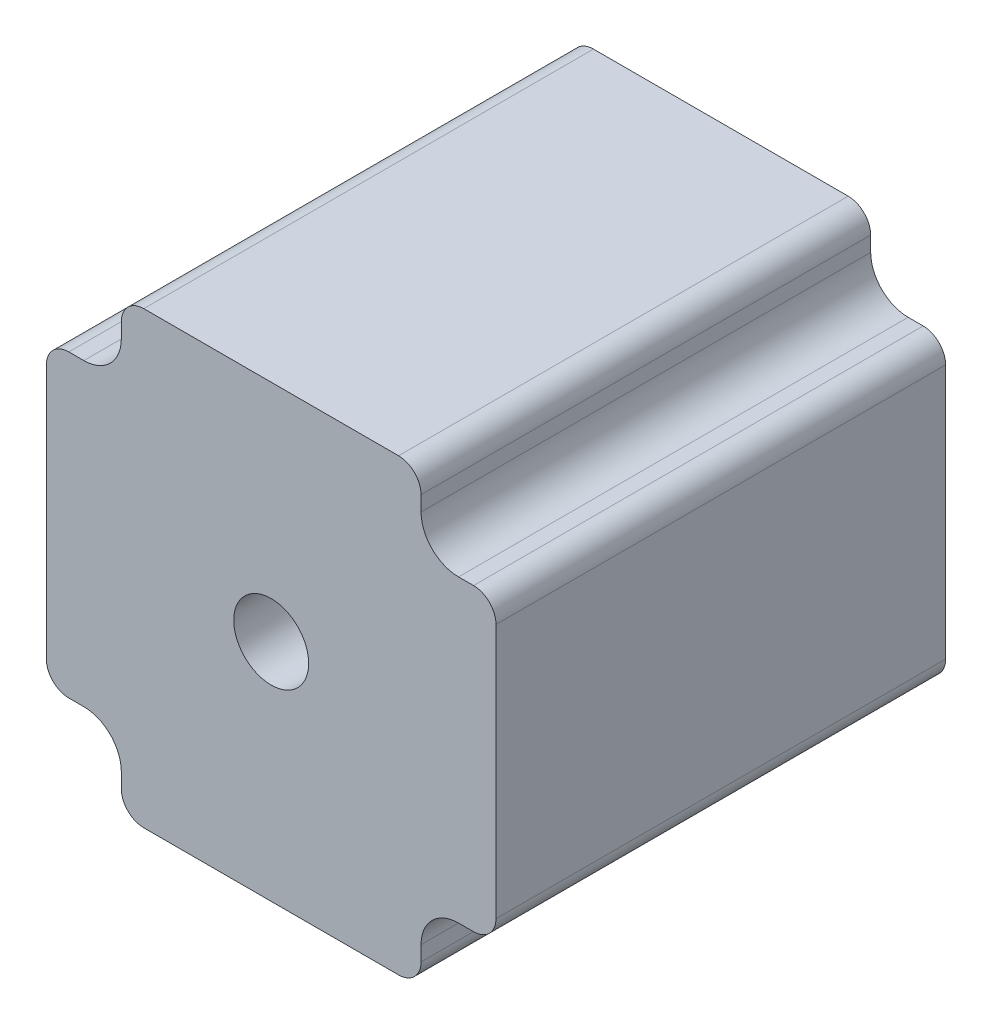
ISO-10303-21;
HEADER;
FILE_DESCRIPTION(('STEP AP214'),'2;1');
FILE_NAME('part.step','',(''),(''),'','','');
FILE_SCHEMA(('AUTOMOTIVE_DESIGN { 1 0 10303 214 1 1 1 1 }'));
ENDSEC;
DATA;
#1=APPLICATION_CONTEXT('core data for automotive mechanical design processes');
#2=APPLICATION_PROTOCOL_DEFINITION('international standard','automotive_design',2000,#1);
#3=PRODUCT_CONTEXT('',#1,'mechanical');
#4=PRODUCT('Part','Part','',(#3));
#5=PRODUCT_RELATED_PRODUCT_CATEGORY('part','',(#4));
#6=PRODUCT_DEFINITION_FORMATION('','',#4);
#7=PRODUCT_DEFINITION_CONTEXT('part definition',#1,'design');
#8=PRODUCT_DEFINITION('design','',#6,#7);
#9=PRODUCT_DEFINITION_SHAPE('','',#8);
#10=(LENGTH_UNIT() NAMED_UNIT(*) SI_UNIT(.MILLI.,.METRE.));
#11=(NAMED_UNIT(*) PLANE_ANGLE_UNIT() SI_UNIT($,.RADIAN.));
#12=(NAMED_UNIT(*) SI_UNIT($,.STERADIAN.) SOLID_ANGLE_UNIT());
#13=UNCERTAINTY_MEASURE_WITH_UNIT(LENGTH_MEASURE(1.E-05),#10,'distance_accuracy_value','');
#14=(GEOMETRIC_REPRESENTATION_CONTEXT(3) GLOBAL_UNCERTAINTY_ASSIGNED_CONTEXT((#13)) GLOBAL_UNIT_ASSIGNED_CONTEXT((#10,
#11,#12)) REPRESENTATION_CONTEXT('',''));
#15=CARTESIAN_POINT('',(0.,0.,0.));
#16=DIRECTION('',(0.,0.,1.));
#17=DIRECTION('',(1.,0.,0.));
#18=AXIS2_PLACEMENT_3D('',#15,#16,#17);
#19=CARTESIAN_POINT('',(-50.2998692886061,-21.2682776228901,60.));
#20=DIRECTION('',(0.,0.,-1.));
#21=DIRECTION('',(-1.,0.,0.));
#22=AXIS2_PLACEMENT_3D('',#19,#20,#21);
#23=CYLINDRICAL_SURFACE('',#22,5.);
#24=CARTESIAN_POINT('',(-50.2998692886061,-21.2682776228901,0.));
#25=DIRECTION('',(0.,0.,-1.));
#26=DIRECTION('',(1.,0.,0.));
#27=AXIS2_PLACEMENT_3D('',#24,#25,#26);
#28=CIRCLE('',#27,5.);
#29=CARTESIAN_POINT('',(-50.2998692886062,-16.2682776228901,0.));
#30=VERTEX_POINT('',#29);
#31=CARTESIAN_POINT('',(-45.2998692886061,-21.2682776228901,0.));
#32=VERTEX_POINT('',#31);
#33=EDGE_CURVE('E228',#30,#32,#28,.T.);
#34=ORIENTED_EDGE('',*,*,#33,.T.);
#35=DIRECTION('',(0.,0.,-1.));
#36=VECTOR('',#35,1.);
#37=CARTESIAN_POINT('',(-45.2998692886061,-21.2682776228901,60.));
#38=LINE('',#37,#36);
#39=CARTESIAN_POINT('',(-45.2998692886061,-21.2682776228901,60.));
#40=VERTEX_POINT('',#39);
#41=EDGE_CURVE('E11',#40,#32,#38,.T.);
#42=ORIENTED_EDGE('',*,*,#41,.F.);
#43=CARTESIAN_POINT('',(-50.2998692886061,-21.2682776228901,60.));
#44=DIRECTION('',(0.,0.,-1.));
#45=DIRECTION('',(1.,0.,0.));
#46=AXIS2_PLACEMENT_3D('',#43,#44,#45);
#47=CIRCLE('',#46,5.);
#48=CARTESIAN_POINT('',(-50.2998692886062,-16.2682776228901,60.));
#49=VERTEX_POINT('',#48);
#50=EDGE_CURVE('E275',#49,#40,#47,.T.);
#51=ORIENTED_EDGE('',*,*,#50,.F.);
#52=DIRECTION('',(0.,0.,-1.));
#53=VECTOR('',#52,1.);
#54=CARTESIAN_POINT('',(-50.2998692886062,-16.2682776228901,60.));
#55=LINE('',#54,#53);
#56=EDGE_CURVE('E224',#49,#30,#55,.T.);
#57=ORIENTED_EDGE('',*,*,#56,.T.);
#58=EDGE_LOOP('',(#34,#42,#51,#57));
#59=FACE_BOUND('',#58,.T.);
#60=ADVANCED_FACE('F36',(#59),#23,.F.);
#61=CARTESIAN_POINT('',(-45.2998692886061,-23.2682776228901,60.));
#62=DIRECTION('',(1.,0.,0.));
#63=DIRECTION('',(0.,0.,-1.));
#64=AXIS2_PLACEMENT_3D('',#61,#62,#63);
#65=PLANE('',#64);
#66=DIRECTION('',(0.,-1.,0.));
#67=VECTOR('',#66,1.);
#68=CARTESIAN_POINT('',(-45.2998692886061,-23.2682776228901,0.));
#69=LINE('',#68,#67);
#70=CARTESIAN_POINT('',(-45.2998692886061,-23.2682776228901,0.));
#71=VERTEX_POINT('',#70);
#72=EDGE_CURVE('E231',#32,#71,#69,.T.);
#73=ORIENTED_EDGE('',*,*,#72,.T.);
#74=DIRECTION('',(0.,0.,-1.));
#75=VECTOR('',#74,1.);
#76=CARTESIAN_POINT('',(-45.2998692886061,-23.2682776228901,60.));
#77=LINE('',#76,#75);
#78=CARTESIAN_POINT('',(-45.2998692886061,-23.2682776228901,60.));
#79=VERTEX_POINT('',#78);
#80=EDGE_CURVE('E44',#79,#71,#77,.T.);
#81=ORIENTED_EDGE('',*,*,#80,.F.);
#82=DIRECTION('',(0.,-1.,0.));
#83=VECTOR('',#82,1.);
#84=CARTESIAN_POINT('',(-45.2998692886061,-23.2682776228901,60.));
#85=LINE('',#84,#83);
#86=EDGE_CURVE('E143',#40,#79,#85,.T.);
#87=ORIENTED_EDGE('',*,*,#86,.F.);
#88=ORIENTED_EDGE('',*,*,#41,.T.);
#89=EDGE_LOOP('',(#73,#81,#87,#88));
#90=FACE_BOUND('',#89,.T.);
#91=ADVANCED_FACE('F414',(#90),#65,.F.);
#92=CARTESIAN_POINT('',(-42.2998692886061,-23.2682776228901,60.));
#93=DIRECTION('',(0.,0.,-1.));
#94=DIRECTION('',(-1.,0.,0.));
#95=AXIS2_PLACEMENT_3D('',#92,#93,#94);
#96=CYLINDRICAL_SURFACE('',#95,3.);
#97=CARTESIAN_POINT('',(-42.2998692886061,-23.2682776228901,0.));
#98=DIRECTION('',(0.,0.,1.));
#99=DIRECTION('',(1.,0.,0.));
#100=AXIS2_PLACEMENT_3D('',#97,#98,#99);
#101=CIRCLE('',#100,3.);
#102=CARTESIAN_POINT('',(-42.2998692886061,-26.2682776228901,0.));
#103=VERTEX_POINT('',#102);
#104=EDGE_CURVE('E234',#71,#103,#101,.T.);
#105=ORIENTED_EDGE('',*,*,#104,.T.);
#106=DIRECTION('',(0.,0.,-1.));
#107=VECTOR('',#106,1.);
#108=CARTESIAN_POINT('',(-42.2998692886061,-26.2682776228901,60.));
#109=LINE('',#108,#107);
#110=CARTESIAN_POINT('',(-42.2998692886061,-26.2682776228901,60.));
#111=VERTEX_POINT('',#110);
#112=EDGE_CURVE('E330',#111,#103,#109,.T.);
#113=ORIENTED_EDGE('',*,*,#112,.F.);
#114=CARTESIAN_POINT('',(-42.2998692886061,-23.2682776228901,60.));
#115=DIRECTION('',(0.,0.,1.));
#116=DIRECTION('',(1.,0.,0.));
#117=AXIS2_PLACEMENT_3D('',#114,#115,#116);
#118=CIRCLE('',#117,3.);
#119=EDGE_CURVE('E338',#79,#111,#118,.T.);
#120=ORIENTED_EDGE('',*,*,#119,.F.);
#121=ORIENTED_EDGE('',*,*,#80,.T.);
#122=EDGE_LOOP('',(#105,#113,#120,#121));
#123=FACE_BOUND('',#122,.T.);
#124=ADVANCED_FACE('F336',(#123),#96,.T.);
#125=CARTESIAN_POINT('',(-42.2998692886061,-26.2682776228901,60.));
#126=DIRECTION('',(0.,1.,0.));
#127=DIRECTION('',(0.,0.,1.));
#128=AXIS2_PLACEMENT_3D('',#125,#126,#127);
#129=PLANE('',#128);
#130=DIRECTION('',(1.,0.,0.));
#131=VECTOR('',#130,1.);
#132=CARTESIAN_POINT('',(-42.2998692886061,-26.2682776228901,0.));
#133=LINE('',#132,#131);
#134=CARTESIAN_POINT('',(-8.29986928860615,-26.2682776228901,0.));
#135=VERTEX_POINT('',#134);
#136=EDGE_CURVE('E236',#103,#135,#133,.T.);
#137=ORIENTED_EDGE('',*,*,#136,.T.);
#138=DIRECTION('',(0.,0.,-1.));
#139=VECTOR('',#138,1.);
#140=CARTESIAN_POINT('',(-8.29986928860615,-26.2682776228901,60.));
#141=LINE('',#140,#139);
#142=CARTESIAN_POINT('',(-8.29986928860615,-26.2682776228901,60.));
#143=VERTEX_POINT('',#142);
#144=EDGE_CURVE('E327',#143,#135,#141,.T.);
#145=ORIENTED_EDGE('',*,*,#144,.F.);
#146=DIRECTION('',(1.,0.,0.));
#147=VECTOR('',#146,1.);
#148=CARTESIAN_POINT('',(-42.2998692886061,-26.2682776228901,60.));
#149=LINE('',#148,#147);
#150=EDGE_CURVE('E356',#111,#143,#149,.T.);
#151=ORIENTED_EDGE('',*,*,#150,.F.);
#152=ORIENTED_EDGE('',*,*,#112,.T.);
#153=EDGE_LOOP('',(#137,#145,#151,#152));
#154=FACE_BOUND('',#153,.T.);
#155=ADVANCED_FACE('F347',(#154),#129,.F.);
#156=CARTESIAN_POINT('',(-8.29986928860613,-23.2682776228901,60.));
#157=DIRECTION('',(0.,0.,-1.));
#158=DIRECTION('',(-1.,0.,0.));
#159=AXIS2_PLACEMENT_3D('',#156,#157,#158);
#160=CYLINDRICAL_SURFACE('',#159,3.);
#161=CARTESIAN_POINT('',(-8.29986928860613,-23.2682776228901,0.));
#162=DIRECTION('',(0.,0.,1.));
#163=DIRECTION('',(-1.,0.,0.));
#164=AXIS2_PLACEMENT_3D('',#161,#162,#163);
#165=CIRCLE('',#164,3.);
#166=CARTESIAN_POINT('',(-5.29986928860613,-23.2682776228901,0.));
#167=VERTEX_POINT('',#166);
#168=EDGE_CURVE('E238',#135,#167,#165,.T.);
#169=ORIENTED_EDGE('',*,*,#168,.T.);
#170=DIRECTION('',(0.,0.,-1.));
#171=VECTOR('',#170,1.);
#172=CARTESIAN_POINT('',(-5.29986928860613,-23.2682776228901,60.));
#173=LINE('',#172,#171);
#174=CARTESIAN_POINT('',(-5.29986928860613,-23.2682776228901,60.));
#175=VERTEX_POINT('',#174);
#176=EDGE_CURVE('E324',#175,#167,#173,.T.);
#177=ORIENTED_EDGE('',*,*,#176,.F.);
#178=CARTESIAN_POINT('',(-8.29986928860613,-23.2682776228901,60.));
#179=DIRECTION('',(0.,0.,1.));
#180=DIRECTION('',(-1.,0.,0.));
#181=AXIS2_PLACEMENT_3D('',#178,#179,#180);
#182=CIRCLE('',#181,3.);
#183=EDGE_CURVE('E353',#143,#175,#182,.T.);
#184=ORIENTED_EDGE('',*,*,#183,.F.);
#185=ORIENTED_EDGE('',*,*,#144,.T.);
#186=EDGE_LOOP('',(#169,#177,#184,#185));
#187=FACE_BOUND('',#186,.T.);
#188=ADVANCED_FACE('F351',(#187),#160,.T.);
#189=CARTESIAN_POINT('',(-5.29986928860613,-23.2682776228901,60.));
#190=DIRECTION('',(-1.,0.,0.));
#191=DIRECTION('',(0.,0.,1.));
#192=AXIS2_PLACEMENT_3D('',#189,#190,#191);
#193=PLANE('',#192);
#194=DIRECTION('',(0.,1.,0.));
#195=VECTOR('',#194,1.);
#196=CARTESIAN_POINT('',(-5.29986928860613,-23.2682776228901,0.));
#197=LINE('',#196,#195);
#198=CARTESIAN_POINT('',(-5.29986928860613,-21.2682776228901,0.));
#199=VERTEX_POINT('',#198);
#200=EDGE_CURVE('E240',#167,#199,#197,.T.);
#201=ORIENTED_EDGE('',*,*,#200,.T.);
#202=DIRECTION('',(0.,0.,-1.));
#203=VECTOR('',#202,1.);
#204=CARTESIAN_POINT('',(-5.29986928860613,-21.2682776228901,60.));
#205=LINE('',#204,#203);
#206=CARTESIAN_POINT('',(-5.29986928860613,-21.2682776228901,60.));
#207=VERTEX_POINT('',#206);
#208=EDGE_CURVE('E321',#207,#199,#205,.T.);
#209=ORIENTED_EDGE('',*,*,#208,.F.);
#210=DIRECTION('',(0.,1.,0.));
#211=VECTOR('',#210,1.);
#212=CARTESIAN_POINT('',(-5.29986928860613,-23.2682776228901,60.));
#213=LINE('',#212,#211);
#214=EDGE_CURVE('E355',#175,#207,#213,.T.);
#215=ORIENTED_EDGE('',*,*,#214,.F.);
#216=ORIENTED_EDGE('',*,*,#176,.T.);
#217=EDGE_LOOP('',(#201,#209,#215,#216));
#218=FACE_BOUND('',#217,.T.);
#219=ADVANCED_FACE('F427',(#218),#193,.F.);
#220=CARTESIAN_POINT('',(-0.29986928860613,-21.2682776228901,60.));
#221=DIRECTION('',(0.,0.,-1.));
#222=DIRECTION('',(-1.,0.,0.));
#223=AXIS2_PLACEMENT_3D('',#220,#221,#222);
#224=CYLINDRICAL_SURFACE('',#223,5.);
#225=CARTESIAN_POINT('',(-0.29986928860613,-21.2682776228901,0.));
#226=DIRECTION('',(0.,0.,-1.));
#227=DIRECTION('',(-1.,0.,0.));
#228=AXIS2_PLACEMENT_3D('',#225,#226,#227);
#229=CIRCLE('',#228,5.);
#230=CARTESIAN_POINT('',(-0.299869288606095,-16.2682776228901,0.));
#231=VERTEX_POINT('',#230);
#232=EDGE_CURVE('E242',#199,#231,#229,.T.);
#233=ORIENTED_EDGE('',*,*,#232,.T.);
#234=DIRECTION('',(0.,0.,-1.));
#235=VECTOR('',#234,1.);
#236=CARTESIAN_POINT('',(-0.299869288606095,-16.2682776228901,60.));
#237=LINE('',#236,#235);
#238=CARTESIAN_POINT('',(-0.299869288606095,-16.2682776228901,60.));
#239=VERTEX_POINT('',#238);
#240=EDGE_CURVE('E318',#239,#231,#237,.T.);
#241=ORIENTED_EDGE('',*,*,#240,.F.);
#242=CARTESIAN_POINT('',(-0.29986928860613,-21.2682776228901,60.));
#243=DIRECTION('',(0.,0.,-1.));
#244=DIRECTION('',(-1.,0.,0.));
#245=AXIS2_PLACEMENT_3D('',#242,#243,#244);
#246=CIRCLE('',#245,5.);
#247=EDGE_CURVE('E358',#207,#239,#246,.T.);
#248=ORIENTED_EDGE('',*,*,#247,.F.);
#249=ORIENTED_EDGE('',*,*,#208,.T.);
#250=EDGE_LOOP('',(#233,#241,#248,#249));
#251=FACE_BOUND('',#250,.T.);
#252=ADVANCED_FACE('F430',(#251),#224,.F.);
#253=CARTESIAN_POINT('',(-0.299869288606094,-16.2682776228901,60.));
#254=DIRECTION('',(0.,1.,0.));
#255=DIRECTION('',(0.,0.,1.));
#256=AXIS2_PLACEMENT_3D('',#253,#254,#255);
#257=PLANE('',#256);
#258=DIRECTION('',(1.,0.,0.));
#259=VECTOR('',#258,1.);
#260=CARTESIAN_POINT('',(-0.299869288606094,-16.2682776228901,0.));
#261=LINE('',#260,#259);
#262=CARTESIAN_POINT('',(1.70013071139385,-16.2682776228901,0.));
#263=VERTEX_POINT('',#262);
#264=EDGE_CURVE('E244',#231,#263,#261,.T.);
#265=ORIENTED_EDGE('',*,*,#264,.T.);
#266=DIRECTION('',(0.,0.,-1.));
#267=VECTOR('',#266,1.);
#268=CARTESIAN_POINT('',(1.70013071139385,-16.2682776228901,60.));
#269=LINE('',#268,#267);
#270=CARTESIAN_POINT('',(1.70013071139385,-16.2682776228901,60.));
#271=VERTEX_POINT('',#270);
#272=EDGE_CURVE('E315',#271,#263,#269,.T.);
#273=ORIENTED_EDGE('',*,*,#272,.F.);
#274=DIRECTION('',(1.,0.,0.));
#275=VECTOR('',#274,1.);
#276=CARTESIAN_POINT('',(-0.299869288606094,-16.2682776228901,60.));
#277=LINE('',#276,#275);
#278=EDGE_CURVE('E364',#239,#271,#277,.T.);
#279=ORIENTED_EDGE('',*,*,#278,.F.);
#280=ORIENTED_EDGE('',*,*,#240,.T.);
#281=EDGE_LOOP('',(#265,#273,#279,#280));
#282=FACE_BOUND('',#281,.T.);
#283=ADVANCED_FACE('F434',(#282),#257,.F.);
#284=CARTESIAN_POINT('',(1.70013071139387,-13.2682776228901,60.));
#285=DIRECTION('',(0.,0.,-1.));
#286=DIRECTION('',(-1.,0.,0.));
#287=AXIS2_PLACEMENT_3D('',#284,#285,#286);
#288=CYLINDRICAL_SURFACE('',#287,3.);
#289=CARTESIAN_POINT('',(1.70013071139387,-13.2682776228901,0.));
#290=DIRECTION('',(0.,0.,1.));
#291=DIRECTION('',(1.,0.,0.));
#292=AXIS2_PLACEMENT_3D('',#289,#290,#291);
#293=CIRCLE('',#292,3.);
#294=CARTESIAN_POINT('',(4.70013071139387,-13.2682776228901,0.));
#295=VERTEX_POINT('',#294);
#296=EDGE_CURVE('E246',#263,#295,#293,.T.);
#297=ORIENTED_EDGE('',*,*,#296,.T.);
#298=DIRECTION('',(0.,0.,-1.));
#299=VECTOR('',#298,1.);
#300=CARTESIAN_POINT('',(4.70013071139387,-13.2682776228901,60.));
#301=LINE('',#300,#299);
#302=CARTESIAN_POINT('',(4.70013071139387,-13.2682776228901,60.));
#303=VERTEX_POINT('',#302);
#304=EDGE_CURVE('E312',#303,#295,#301,.T.);
#305=ORIENTED_EDGE('',*,*,#304,.F.);
#306=CARTESIAN_POINT('',(1.70013071139387,-13.2682776228901,60.));
#307=DIRECTION('',(0.,0.,1.));
#308=DIRECTION('',(1.,0.,0.));
#309=AXIS2_PLACEMENT_3D('',#306,#307,#308);
#310=CIRCLE('',#309,3.);
#311=EDGE_CURVE('E366',#271,#303,#310,.T.);
#312=ORIENTED_EDGE('',*,*,#311,.F.);
#313=ORIENTED_EDGE('',*,*,#272,.T.);
#314=EDGE_LOOP('',(#297,#305,#312,#313));
#315=FACE_BOUND('',#314,.T.);
#316=ADVANCED_FACE('F438',(#315),#288,.T.);
#317=CARTESIAN_POINT('',(4.70013071139387,20.7317223771099,60.));
#318=DIRECTION('',(-1.,0.,0.));
#319=DIRECTION('',(0.,-1.,0.));
#320=AXIS2_PLACEMENT_3D('',#317,#318,#319);
#321=PLANE('',#320);
#322=DIRECTION('',(0.,1.,0.));
#323=VECTOR('',#322,1.);
#324=CARTESIAN_POINT('',(4.70013071139387,20.7317223771099,0.));
#325=LINE('',#324,#323);
#326=CARTESIAN_POINT('',(4.70013071139387,20.7317223771099,0.));
#327=VERTEX_POINT('',#326);
#328=EDGE_CURVE('E248',#295,#327,#325,.T.);
#329=ORIENTED_EDGE('',*,*,#328,.T.);
#330=DIRECTION('',(0.,0.,-1.));
#331=VECTOR('',#330,1.);
#332=CARTESIAN_POINT('',(4.70013071139387,20.7317223771099,60.));
#333=LINE('',#332,#331);
#334=CARTESIAN_POINT('',(4.70013071139387,20.7317223771099,60.));
#335=VERTEX_POINT('',#334);
#336=EDGE_CURVE('E309',#335,#327,#333,.T.);
#337=ORIENTED_EDGE('',*,*,#336,.F.);
#338=DIRECTION('',(0.,1.,0.));
#339=VECTOR('',#338,1.);
#340=CARTESIAN_POINT('',(4.70013071139387,20.7317223771099,60.));
#341=LINE('',#340,#339);
#342=EDGE_CURVE('E368',#303,#335,#341,.T.);
#343=ORIENTED_EDGE('',*,*,#342,.F.);
#344=ORIENTED_EDGE('',*,*,#304,.T.);
#345=EDGE_LOOP('',(#329,#337,#343,#344));
#346=FACE_BOUND('',#345,.T.);
#347=ADVANCED_FACE('F442',(#346),#321,.F.);
#348=CARTESIAN_POINT('',(1.70013071139387,20.7317223771099,60.));
#349=DIRECTION('',(0.,0.,-1.));
#350=DIRECTION('',(-1.,0.,0.));
#351=AXIS2_PLACEMENT_3D('',#348,#349,#350);
#352=CYLINDRICAL_SURFACE('',#351,3.);
#353=CARTESIAN_POINT('',(1.70013071139387,20.7317223771099,0.));
#354=DIRECTION('',(0.,0.,1.));
#355=DIRECTION('',(-1.,0.,0.));
#356=AXIS2_PLACEMENT_3D('',#353,#354,#355);
#357=CIRCLE('',#356,3.);
#358=CARTESIAN_POINT('',(1.70013071139384,23.7317223771099,0.));
#359=VERTEX_POINT('',#358);
#360=EDGE_CURVE('E250',#327,#359,#357,.T.);
#361=ORIENTED_EDGE('',*,*,#360,.T.);
#362=DIRECTION('',(0.,0.,-1.));
#363=VECTOR('',#362,1.);
#364=CARTESIAN_POINT('',(1.70013071139384,23.7317223771099,60.));
#365=LINE('',#364,#363);
#366=CARTESIAN_POINT('',(1.70013071139384,23.7317223771099,60.));
#367=VERTEX_POINT('',#366);
#368=EDGE_CURVE('E306',#367,#359,#365,.T.);
#369=ORIENTED_EDGE('',*,*,#368,.F.);
#370=CARTESIAN_POINT('',(1.70013071139387,20.7317223771099,60.));
#371=DIRECTION('',(0.,0.,1.));
#372=DIRECTION('',(-1.,0.,0.));
#373=AXIS2_PLACEMENT_3D('',#370,#371,#372);
#374=CIRCLE('',#373,3.);
#375=EDGE_CURVE('E370',#335,#367,#374,.T.);
#376=ORIENTED_EDGE('',*,*,#375,.F.);
#377=ORIENTED_EDGE('',*,*,#336,.T.);
#378=EDGE_LOOP('',(#361,#369,#376,#377));
#379=FACE_BOUND('',#378,.T.);
#380=ADVANCED_FACE('F446',(#379),#352,.T.);
#381=CARTESIAN_POINT('',(1.70013071139385,23.7317223771099,60.));
#382=DIRECTION('',(0.,-1.,0.));
#383=DIRECTION('',(0.,0.,-1.));
#384=AXIS2_PLACEMENT_3D('',#381,#382,#383);
#385=PLANE('',#384);
#386=DIRECTION('',(-1.,0.,0.));
#387=VECTOR('',#386,1.);
#388=CARTESIAN_POINT('',(1.70013071139385,23.7317223771099,0.));
#389=LINE('',#388,#387);
#390=CARTESIAN_POINT('',(-0.299869288606095,23.7317223771099,0.));
#391=VERTEX_POINT('',#390);
#392=EDGE_CURVE('E252',#359,#391,#389,.T.);
#393=ORIENTED_EDGE('',*,*,#392,.T.);
#394=DIRECTION('',(0.,0.,-1.));
#395=VECTOR('',#394,1.);
#396=CARTESIAN_POINT('',(-0.299869288606095,23.7317223771099,60.));
#397=LINE('',#396,#395);
#398=CARTESIAN_POINT('',(-0.299869288606095,23.7317223771099,60.));
#399=VERTEX_POINT('',#398);
#400=EDGE_CURVE('E303',#399,#391,#397,.T.);
#401=ORIENTED_EDGE('',*,*,#400,.F.);
#402=DIRECTION('',(-1.,0.,0.));
#403=VECTOR('',#402,1.);
#404=CARTESIAN_POINT('',(1.70013071139385,23.7317223771099,60.));
#405=LINE('',#404,#403);
#406=EDGE_CURVE('E372',#367,#399,#405,.T.);
#407=ORIENTED_EDGE('',*,*,#406,.F.);
#408=ORIENTED_EDGE('',*,*,#368,.T.);
#409=EDGE_LOOP('',(#393,#401,#407,#408));
#410=FACE_BOUND('',#409,.T.);
#411=ADVANCED_FACE('F450',(#410),#385,.F.);
#412=CARTESIAN_POINT('',(-0.299869288606131,28.7317223771099,60.));
#413=DIRECTION('',(0.,0.,-1.));
#414=DIRECTION('',(-1.,0.,0.));
#415=AXIS2_PLACEMENT_3D('',#412,#413,#414);
#416=CYLINDRICAL_SURFACE('',#415,5.);
#417=CARTESIAN_POINT('',(-0.299869288606131,28.7317223771099,0.));
#418=DIRECTION('',(0.,0.,-1.));
#419=DIRECTION('',(-1.,0.,0.));
#420=AXIS2_PLACEMENT_3D('',#417,#418,#419);
#421=CIRCLE('',#420,5.);
#422=CARTESIAN_POINT('',(-5.29986928860613,28.7317223771099,0.));
#423=VERTEX_POINT('',#422);
#424=EDGE_CURVE('E254',#391,#423,#421,.T.);
#425=ORIENTED_EDGE('',*,*,#424,.T.);
#426=DIRECTION('',(0.,0.,-1.));
#427=VECTOR('',#426,1.);
#428=CARTESIAN_POINT('',(-5.29986928860613,28.7317223771099,60.));
#429=LINE('',#428,#427);
#430=CARTESIAN_POINT('',(-5.29986928860613,28.7317223771099,60.));
#431=VERTEX_POINT('',#430);
#432=EDGE_CURVE('E300',#431,#423,#429,.T.);
#433=ORIENTED_EDGE('',*,*,#432,.F.);
#434=CARTESIAN_POINT('',(-0.299869288606131,28.7317223771099,60.));
#435=DIRECTION('',(0.,0.,-1.));
#436=DIRECTION('',(-1.,0.,0.));
#437=AXIS2_PLACEMENT_3D('',#434,#435,#436);
#438=CIRCLE('',#437,5.);
#439=EDGE_CURVE('E374',#399,#431,#438,.T.);
#440=ORIENTED_EDGE('',*,*,#439,.F.);
#441=ORIENTED_EDGE('',*,*,#400,.T.);
#442=EDGE_LOOP('',(#425,#433,#440,#441));
#443=FACE_BOUND('',#442,.T.);
#444=ADVANCED_FACE('F454',(#443),#416,.F.);
#445=CARTESIAN_POINT('',(-5.29986928860613,28.7317223771099,60.));
#446=DIRECTION('',(-1.,0.,0.));
#447=DIRECTION('',(0.,0.,1.));
#448=AXIS2_PLACEMENT_3D('',#445,#446,#447);
#449=PLANE('',#448);
#450=DIRECTION('',(0.,1.,0.));
#451=VECTOR('',#450,1.);
#452=CARTESIAN_POINT('',(-5.29986928860613,28.7317223771099,0.));
#453=LINE('',#452,#451);
#454=CARTESIAN_POINT('',(-5.29986928860613,30.7317223771099,0.));
#455=VERTEX_POINT('',#454);
#456=EDGE_CURVE('E256',#423,#455,#453,.T.);
#457=ORIENTED_EDGE('',*,*,#456,.T.);
#458=DIRECTION('',(0.,0.,-1.));
#459=VECTOR('',#458,1.);
#460=CARTESIAN_POINT('',(-5.29986928860613,30.7317223771099,60.));
#461=LINE('',#460,#459);
#462=CARTESIAN_POINT('',(-5.29986928860613,30.7317223771099,60.));
#463=VERTEX_POINT('',#462);
#464=EDGE_CURVE('E297',#463,#455,#461,.T.);
#465=ORIENTED_EDGE('',*,*,#464,.F.);
#466=DIRECTION('',(0.,1.,0.));
#467=VECTOR('',#466,1.);
#468=CARTESIAN_POINT('',(-5.29986928860613,28.7317223771099,60.));
#469=LINE('',#468,#467);
#470=EDGE_CURVE('E376',#431,#463,#469,.T.);
#471=ORIENTED_EDGE('',*,*,#470,.F.);
#472=ORIENTED_EDGE('',*,*,#432,.T.);
#473=EDGE_LOOP('',(#457,#465,#471,#472));
#474=FACE_BOUND('',#473,.T.);
#475=ADVANCED_FACE('F458',(#474),#449,.F.);
#476=CARTESIAN_POINT('',(-8.29986928860613,30.7317223771099,60.));
#477=DIRECTION('',(0.,0.,-1.));
#478=DIRECTION('',(-1.,0.,0.));
#479=AXIS2_PLACEMENT_3D('',#476,#477,#478);
#480=CYLINDRICAL_SURFACE('',#479,3.);
#481=CARTESIAN_POINT('',(-8.29986928860613,30.7317223771099,0.));
#482=DIRECTION('',(0.,0.,1.));
#483=DIRECTION('',(1.,0.,0.));
#484=AXIS2_PLACEMENT_3D('',#481,#482,#483);
#485=CIRCLE('',#484,3.);
#486=CARTESIAN_POINT('',(-8.29986928860615,33.7317223771099,0.));
#487=VERTEX_POINT('',#486);
#488=EDGE_CURVE('E258',#455,#487,#485,.T.);
#489=ORIENTED_EDGE('',*,*,#488,.T.);
#490=DIRECTION('',(0.,0.,-1.));
#491=VECTOR('',#490,1.);
#492=CARTESIAN_POINT('',(-8.29986928860615,33.7317223771099,60.));
#493=LINE('',#492,#491);
#494=CARTESIAN_POINT('',(-8.29986928860615,33.7317223771099,60.));
#495=VERTEX_POINT('',#494);
#496=EDGE_CURVE('E294',#495,#487,#493,.T.);
#497=ORIENTED_EDGE('',*,*,#496,.F.);
#498=CARTESIAN_POINT('',(-8.29986928860613,30.7317223771099,60.));
#499=DIRECTION('',(0.,0.,1.));
#500=DIRECTION('',(1.,0.,0.));
#501=AXIS2_PLACEMENT_3D('',#498,#499,#500);
#502=CIRCLE('',#501,3.);
#503=EDGE_CURVE('E378',#463,#495,#502,.T.);
#504=ORIENTED_EDGE('',*,*,#503,.F.);
#505=ORIENTED_EDGE('',*,*,#464,.T.);
#506=EDGE_LOOP('',(#489,#497,#504,#505));
#507=FACE_BOUND('',#506,.T.);
#508=ADVANCED_FACE('F462',(#507),#480,.T.);
#509=CARTESIAN_POINT('',(-42.2998692886061,33.7317223771099,60.));
#510=DIRECTION('',(0.,-1.,0.));
#511=DIRECTION('',(0.,0.,-1.));
#512=AXIS2_PLACEMENT_3D('',#509,#510,#511);
#513=PLANE('',#512);
#514=DIRECTION('',(-1.,0.,0.));
#515=VECTOR('',#514,1.);
#516=CARTESIAN_POINT('',(-42.2998692886061,33.7317223771099,0.));
#517=LINE('',#516,#515);
#518=CARTESIAN_POINT('',(-42.2998692886061,33.7317223771099,0.));
#519=VERTEX_POINT('',#518);
#520=EDGE_CURVE('E260',#487,#519,#517,.T.);
#521=ORIENTED_EDGE('',*,*,#520,.T.);
#522=DIRECTION('',(0.,0.,-1.));
#523=VECTOR('',#522,1.);
#524=CARTESIAN_POINT('',(-42.2998692886061,33.7317223771099,60.));
#525=LINE('',#524,#523);
#526=CARTESIAN_POINT('',(-42.2998692886061,33.7317223771099,60.));
#527=VERTEX_POINT('',#526);
#528=EDGE_CURVE('E291',#527,#519,#525,.T.);
#529=ORIENTED_EDGE('',*,*,#528,.F.);
#530=DIRECTION('',(-1.,0.,0.));
#531=VECTOR('',#530,1.);
#532=CARTESIAN_POINT('',(-42.2998692886061,33.7317223771099,60.));
#533=LINE('',#532,#531);
#534=EDGE_CURVE('E380',#495,#527,#533,.T.);
#535=ORIENTED_EDGE('',*,*,#534,.F.);
#536=ORIENTED_EDGE('',*,*,#496,.T.);
#537=EDGE_LOOP('',(#521,#529,#535,#536));
#538=FACE_BOUND('',#537,.T.);
#539=ADVANCED_FACE('F466',(#538),#513,.F.);
#540=CARTESIAN_POINT('',(-42.2998692886061,30.7317223771099,60.));
#541=DIRECTION('',(0.,0.,-1.));
#542=DIRECTION('',(-1.,0.,0.));
#543=AXIS2_PLACEMENT_3D('',#540,#541,#542);
#544=CYLINDRICAL_SURFACE('',#543,3.);
#545=CARTESIAN_POINT('',(-42.2998692886061,30.7317223771099,0.));
#546=DIRECTION('',(0.,0.,1.));
#547=DIRECTION('',(-1.,0.,0.));
#548=AXIS2_PLACEMENT_3D('',#545,#546,#547);
#549=CIRCLE('',#548,3.);
#550=CARTESIAN_POINT('',(-45.2998692886061,30.7317223771099,0.));
#551=VERTEX_POINT('',#550);
#552=EDGE_CURVE('E262',#519,#551,#549,.T.);
#553=ORIENTED_EDGE('',*,*,#552,.T.);
#554=DIRECTION('',(0.,0.,-1.));
#555=VECTOR('',#554,1.);
#556=CARTESIAN_POINT('',(-45.2998692886061,30.7317223771099,60.));
#557=LINE('',#556,#555);
#558=CARTESIAN_POINT('',(-45.2998692886061,30.7317223771099,60.));
#559=VERTEX_POINT('',#558);
#560=EDGE_CURVE('E288',#559,#551,#557,.T.);
#561=ORIENTED_EDGE('',*,*,#560,.F.);
#562=CARTESIAN_POINT('',(-42.2998692886061,30.7317223771099,60.));
#563=DIRECTION('',(0.,0.,1.));
#564=DIRECTION('',(-1.,0.,0.));
#565=AXIS2_PLACEMENT_3D('',#562,#563,#564);
#566=CIRCLE('',#565,3.);
#567=EDGE_CURVE('E382',#527,#559,#566,.T.);
#568=ORIENTED_EDGE('',*,*,#567,.F.);
#569=ORIENTED_EDGE('',*,*,#528,.T.);
#570=EDGE_LOOP('',(#553,#561,#568,#569));
#571=FACE_BOUND('',#570,.T.);
#572=ADVANCED_FACE('F470',(#571),#544,.T.);
#573=CARTESIAN_POINT('',(-45.2998692886061,30.7317223771099,60.));
#574=DIRECTION('',(1.,0.,0.));
#575=DIRECTION('',(0.,0.,-1.));
#576=AXIS2_PLACEMENT_3D('',#573,#574,#575);
#577=PLANE('',#576);
#578=DIRECTION('',(0.,-1.,0.));
#579=VECTOR('',#578,1.);
#580=CARTESIAN_POINT('',(-45.2998692886061,30.7317223771099,0.));
#581=LINE('',#580,#579);
#582=CARTESIAN_POINT('',(-45.2998692886061,28.7317223771099,0.));
#583=VERTEX_POINT('',#582);
#584=EDGE_CURVE('E264',#551,#583,#581,.T.);
#585=ORIENTED_EDGE('',*,*,#584,.T.);
#586=DIRECTION('',(0.,0.,-1.));
#587=VECTOR('',#586,1.);
#588=CARTESIAN_POINT('',(-45.2998692886061,28.7317223771099,60.));
#589=LINE('',#588,#587);
#590=CARTESIAN_POINT('',(-45.2998692886061,28.7317223771099,60.));
#591=VERTEX_POINT('',#590);
#592=EDGE_CURVE('E285',#591,#583,#589,.T.);
#593=ORIENTED_EDGE('',*,*,#592,.F.);
#594=DIRECTION('',(0.,-1.,0.));
#595=VECTOR('',#594,1.);
#596=CARTESIAN_POINT('',(-45.2998692886061,30.7317223771099,60.));
#597=LINE('',#596,#595);
#598=EDGE_CURVE('E384',#559,#591,#597,.T.);
#599=ORIENTED_EDGE('',*,*,#598,.F.);
#600=ORIENTED_EDGE('',*,*,#560,.T.);
#601=EDGE_LOOP('',(#585,#593,#599,#600));
#602=FACE_BOUND('',#601,.T.);
#603=ADVANCED_FACE('F474',(#602),#577,.F.);
#604=CARTESIAN_POINT('',(-50.2998692886061,28.7317223771099,60.));
#605=DIRECTION('',(0.,0.,-1.));
#606=DIRECTION('',(-1.,0.,0.));
#607=AXIS2_PLACEMENT_3D('',#604,#605,#606);
#608=CYLINDRICAL_SURFACE('',#607,5.);
#609=CARTESIAN_POINT('',(-50.2998692886061,28.7317223771099,0.));
#610=DIRECTION('',(0.,0.,-1.));
#611=DIRECTION('',(-1.,0.,0.));
#612=AXIS2_PLACEMENT_3D('',#609,#610,#611);
#613=CIRCLE('',#612,5.);
#614=CARTESIAN_POINT('',(-50.2998692886062,23.7317223771099,0.));
#615=VERTEX_POINT('',#614);
#616=EDGE_CURVE('E266',#583,#615,#613,.T.);
#617=ORIENTED_EDGE('',*,*,#616,.T.);
#618=DIRECTION('',(0.,0.,-1.));
#619=VECTOR('',#618,1.);
#620=CARTESIAN_POINT('',(-50.2998692886062,23.7317223771099,60.));
#621=LINE('',#620,#619);
#622=CARTESIAN_POINT('',(-50.2998692886062,23.7317223771099,60.));
#623=VERTEX_POINT('',#622);
#624=EDGE_CURVE('E282',#623,#615,#621,.T.);
#625=ORIENTED_EDGE('',*,*,#624,.F.);
#626=CARTESIAN_POINT('',(-50.2998692886061,28.7317223771099,60.));
#627=DIRECTION('',(0.,0.,-1.));
#628=DIRECTION('',(-1.,0.,0.));
#629=AXIS2_PLACEMENT_3D('',#626,#627,#628);
#630=CIRCLE('',#629,5.);
#631=EDGE_CURVE('E386',#591,#623,#630,.T.);
#632=ORIENTED_EDGE('',*,*,#631,.F.);
#633=ORIENTED_EDGE('',*,*,#592,.T.);
#634=EDGE_LOOP('',(#617,#625,#632,#633));
#635=FACE_BOUND('',#634,.T.);
#636=ADVANCED_FACE('F478',(#635),#608,.F.);
#637=CARTESIAN_POINT('',(-50.2998692886062,23.7317223771099,60.));
#638=DIRECTION('',(0.,-1.,0.));
#639=DIRECTION('',(0.,0.,-1.));
#640=AXIS2_PLACEMENT_3D('',#637,#638,#639);
#641=PLANE('',#640);
#642=DIRECTION('',(-1.,0.,0.));
#643=VECTOR('',#642,1.);
#644=CARTESIAN_POINT('',(-50.2998692886062,23.7317223771099,0.));
#645=LINE('',#644,#643);
#646=CARTESIAN_POINT('',(-52.2998692886061,23.7317223771099,0.));
#647=VERTEX_POINT('',#646);
#648=EDGE_CURVE('E268',#615,#647,#645,.T.);
#649=ORIENTED_EDGE('',*,*,#648,.T.);
#650=DIRECTION('',(0.,0.,-1.));
#651=VECTOR('',#650,1.);
#652=CARTESIAN_POINT('',(-52.2998692886061,23.7317223771099,60.));
#653=LINE('',#652,#651);
#654=CARTESIAN_POINT('',(-52.2998692886061,23.7317223771099,60.));
#655=VERTEX_POINT('',#654);
#656=EDGE_CURVE('E279',#655,#647,#653,.T.);
#657=ORIENTED_EDGE('',*,*,#656,.F.);
#658=DIRECTION('',(-1.,0.,0.));
#659=VECTOR('',#658,1.);
#660=CARTESIAN_POINT('',(-50.2998692886062,23.7317223771099,60.));
#661=LINE('',#660,#659);
#662=EDGE_CURVE('E388',#623,#655,#661,.T.);
#663=ORIENTED_EDGE('',*,*,#662,.F.);
#664=ORIENTED_EDGE('',*,*,#624,.T.);
#665=EDGE_LOOP('',(#649,#657,#663,#664));
#666=FACE_BOUND('',#665,.T.);
#667=ADVANCED_FACE('F394',(#666),#641,.F.);
#668=CARTESIAN_POINT('',(-52.2998692886061,20.7317223771099,60.));
#669=DIRECTION('',(0.,0.,-1.));
#670=DIRECTION('',(-1.,0.,0.));
#671=AXIS2_PLACEMENT_3D('',#668,#669,#670);
#672=CYLINDRICAL_SURFACE('',#671,3.);
#673=CARTESIAN_POINT('',(-52.2998692886061,20.7317223771099,0.));
#674=DIRECTION('',(0.,0.,1.));
#675=DIRECTION('',(1.,0.,0.));
#676=AXIS2_PLACEMENT_3D('',#673,#674,#675);
#677=CIRCLE('',#676,3.);
#678=CARTESIAN_POINT('',(-55.2998692886061,20.7317223771099,0.));
#679=VERTEX_POINT('',#678);
#680=EDGE_CURVE('E270',#647,#679,#677,.T.);
#681=ORIENTED_EDGE('',*,*,#680,.T.);
#682=DIRECTION('',(0.,0.,-1.));
#683=VECTOR('',#682,1.);
#684=CARTESIAN_POINT('',(-55.2998692886061,20.7317223771099,60.));
#685=LINE('',#684,#683);
#686=CARTESIAN_POINT('',(-55.2998692886061,20.7317223771099,60.));
#687=VERTEX_POINT('',#686);
#688=EDGE_CURVE('E219',#687,#679,#685,.T.);
#689=ORIENTED_EDGE('',*,*,#688,.F.);
#690=CARTESIAN_POINT('',(-52.2998692886061,20.7317223771099,60.));
#691=DIRECTION('',(0.,0.,1.));
#692=DIRECTION('',(1.,0.,0.));
#693=AXIS2_PLACEMENT_3D('',#690,#691,#692);
#694=CIRCLE('',#693,3.);
#695=EDGE_CURVE('E210',#655,#687,#694,.T.);
#696=ORIENTED_EDGE('',*,*,#695,.F.);
#697=ORIENTED_EDGE('',*,*,#656,.T.);
#698=EDGE_LOOP('',(#681,#689,#696,#697));
#699=FACE_BOUND('',#698,.T.);
#700=ADVANCED_FACE('F398',(#699),#672,.T.);
#701=CARTESIAN_POINT('',(-55.2998692886061,20.7317223771099,60.));
#702=DIRECTION('',(1.,0.,0.));
#703=DIRECTION('',(0.,1.,0.));
#704=AXIS2_PLACEMENT_3D('',#701,#702,#703);
#705=PLANE('',#704);
#706=DIRECTION('',(0.,-1.,0.));
#707=VECTOR('',#706,1.);
#708=CARTESIAN_POINT('',(-55.2998692886061,20.7317223771099,0.));
#709=LINE('',#708,#707);
#710=CARTESIAN_POINT('',(-55.2998692886061,-13.2682776228901,0.));
#711=VERTEX_POINT('',#710);
#712=EDGE_CURVE('E218',#679,#711,#709,.T.);
#713=ORIENTED_EDGE('',*,*,#712,.T.);
#714=DIRECTION('',(0.,0.,-1.));
#715=VECTOR('',#714,1.);
#716=CARTESIAN_POINT('',(-55.2998692886061,-13.2682776228901,60.));
#717=LINE('',#716,#715);
#718=CARTESIAN_POINT('',(-55.2998692886061,-13.2682776228901,60.));
#719=VERTEX_POINT('',#718);
#720=EDGE_CURVE('E215',#719,#711,#717,.T.);
#721=ORIENTED_EDGE('',*,*,#720,.F.);
#722=DIRECTION('',(0.,-1.,0.));
#723=VECTOR('',#722,1.);
#724=CARTESIAN_POINT('',(-55.2998692886061,20.7317223771099,60.));
#725=LINE('',#724,#723);
#726=EDGE_CURVE('E204',#687,#719,#725,.T.);
#727=ORIENTED_EDGE('',*,*,#726,.F.);
#728=ORIENTED_EDGE('',*,*,#688,.T.);
#729=EDGE_LOOP('',(#713,#721,#727,#728));
#730=FACE_BOUND('',#729,.T.);
#731=ADVANCED_FACE('F216',(#730),#705,.F.);
#732=CARTESIAN_POINT('',(-52.2998692886061,-13.2682776228901,60.));
#733=DIRECTION('',(0.,0.,-1.));
#734=DIRECTION('',(-1.,0.,0.));
#735=AXIS2_PLACEMENT_3D('',#732,#733,#734);
#736=CYLINDRICAL_SURFACE('',#735,3.);
#737=CARTESIAN_POINT('',(-52.2998692886061,-13.2682776228901,0.));
#738=DIRECTION('',(0.,0.,1.));
#739=DIRECTION('',(-1.,0.,0.));
#740=AXIS2_PLACEMENT_3D('',#737,#738,#739);
#741=CIRCLE('',#740,3.);
#742=CARTESIAN_POINT('',(-52.2998692886061,-16.2682776228901,0.));
#743=VERTEX_POINT('',#742);
#744=EDGE_CURVE('E129',#711,#743,#741,.T.);
#745=ORIENTED_EDGE('',*,*,#744,.T.);
#746=DIRECTION('',(0.,0.,-1.));
#747=VECTOR('',#746,1.);
#748=CARTESIAN_POINT('',(-52.2998692886061,-16.2682776228901,60.));
#749=LINE('',#748,#747);
#750=CARTESIAN_POINT('',(-52.2998692886061,-16.2682776228901,60.));
#751=VERTEX_POINT('',#750);
#752=EDGE_CURVE('E220',#751,#743,#749,.T.);
#753=ORIENTED_EDGE('',*,*,#752,.F.);
#754=CARTESIAN_POINT('',(-52.2998692886061,-13.2682776228901,60.));
#755=DIRECTION('',(0.,0.,1.));
#756=DIRECTION('',(-1.,0.,0.));
#757=AXIS2_PLACEMENT_3D('',#754,#755,#756);
#758=CIRCLE('',#757,3.);
#759=EDGE_CURVE('E208',#719,#751,#758,.T.);
#760=ORIENTED_EDGE('',*,*,#759,.F.);
#761=ORIENTED_EDGE('',*,*,#720,.T.);
#762=EDGE_LOOP('',(#745,#753,#760,#761));
#763=FACE_BOUND('',#762,.T.);
#764=ADVANCED_FACE('F222',(#763),#736,.T.);
#765=CARTESIAN_POINT('',(-50.2998692886062,-16.2682776228901,60.));
#766=DIRECTION('',(0.,1.,0.));
#767=DIRECTION('',(0.,0.,1.));
#768=AXIS2_PLACEMENT_3D('',#765,#766,#767);
#769=PLANE('',#768);
#770=DIRECTION('',(1.,0.,0.));
#771=VECTOR('',#770,1.);
#772=CARTESIAN_POINT('',(-50.2998692886062,-16.2682776228901,0.));
#773=LINE('',#772,#771);
#774=EDGE_CURVE('E135',#743,#30,#773,.T.);
#775=ORIENTED_EDGE('',*,*,#774,.T.);
#776=ORIENTED_EDGE('',*,*,#56,.F.);
#777=DIRECTION('',(1.,0.,0.));
#778=VECTOR('',#777,1.);
#779=CARTESIAN_POINT('',(-50.2998692886062,-16.2682776228901,60.));
#780=LINE('',#779,#778);
#781=EDGE_CURVE('E52',#751,#49,#780,.T.);
#782=ORIENTED_EDGE('',*,*,#781,.F.);
#783=ORIENTED_EDGE('',*,*,#752,.T.);
#784=EDGE_LOOP('',(#775,#776,#782,#783));
#785=FACE_BOUND('',#784,.T.);
#786=ADVANCED_FACE('F402',(#785),#769,.F.);
#787=CARTESIAN_POINT('',(-50.2998692886061,-21.2682776228901,60.));
#788=DIRECTION('',(0.,0.,1.));
#789=DIRECTION('',(1.,0.,0.));
#790=AXIS2_PLACEMENT_3D('',#787,#788,#789);
#791=PLANE('',#790);
#792=CARTESIAN_POINT('',(-25.2998692886061,3.73172237710989,60.));
#793=DIRECTION('',(0.,0.,1.));
#794=DIRECTION('',(1.,0.,0.));
#795=AXIS2_PLACEMENT_3D('',#792,#793,#794);
#796=CIRCLE('',#795,5.);
#797=CARTESIAN_POINT('',(-20.2998692886061,3.73172237710989,60.));
#798=VERTEX_POINT('',#797);
#799=EDGE_CURVE('E533',#798,#798,#796,.T.);
#800=ORIENTED_EDGE('',*,*,#799,.F.);
#801=EDGE_LOOP('',(#800));
#802=FACE_BOUND('',#801,.T.);
#803=ORIENTED_EDGE('',*,*,#50,.T.);
#804=ORIENTED_EDGE('',*,*,#86,.T.);
#805=ORIENTED_EDGE('',*,*,#119,.T.);
#806=ORIENTED_EDGE('',*,*,#150,.T.);
#807=ORIENTED_EDGE('',*,*,#183,.T.);
#808=ORIENTED_EDGE('',*,*,#214,.T.);
#809=ORIENTED_EDGE('',*,*,#247,.T.);
#810=ORIENTED_EDGE('',*,*,#278,.T.);
#811=ORIENTED_EDGE('',*,*,#311,.T.);
#812=ORIENTED_EDGE('',*,*,#342,.T.);
#813=ORIENTED_EDGE('',*,*,#375,.T.);
#814=ORIENTED_EDGE('',*,*,#406,.T.);
#815=ORIENTED_EDGE('',*,*,#439,.T.);
#816=ORIENTED_EDGE('',*,*,#470,.T.);
#817=ORIENTED_EDGE('',*,*,#503,.T.);
#818=ORIENTED_EDGE('',*,*,#534,.T.);
#819=ORIENTED_EDGE('',*,*,#567,.T.);
#820=ORIENTED_EDGE('',*,*,#598,.T.);
#821=ORIENTED_EDGE('',*,*,#631,.T.);
#822=ORIENTED_EDGE('',*,*,#662,.T.);
#823=ORIENTED_EDGE('',*,*,#695,.T.);
#824=ORIENTED_EDGE('',*,*,#726,.T.);
#825=ORIENTED_EDGE('',*,*,#759,.T.);
#826=ORIENTED_EDGE('',*,*,#781,.T.);
#827=EDGE_LOOP('',(#803,#804,#805,#806,#807,#808,#809,#810,#811,#812,#813,#814,#815,#816,#817,
#818,#819,#820,#821,#822,#823,#824,#825,#826));
#828=FACE_BOUND('',#827,.T.);
#829=ADVANCED_FACE('F206',(#802,#828),#791,.T.);
#830=CARTESIAN_POINT('',(-50.2998692886061,-21.2682776228901,0.));
#831=DIRECTION('',(0.,0.,1.));
#832=DIRECTION('',(1.,0.,0.));
#833=AXIS2_PLACEMENT_3D('',#830,#831,#832);
#834=PLANE('',#833);
#835=CARTESIAN_POINT('',(-25.2998692886061,3.73172237710989,0.));
#836=DIRECTION('',(0.,0.,1.));
#837=DIRECTION('',(1.,0.,0.));
#838=AXIS2_PLACEMENT_3D('',#835,#836,#837);
#839=CIRCLE('',#838,5.);
#840=CARTESIAN_POINT('',(-20.2998692886061,3.73172237710989,0.));
#841=VERTEX_POINT('',#840);
#842=EDGE_CURVE('E232',#841,#841,#839,.T.);
#843=ORIENTED_EDGE('',*,*,#842,.T.);
#844=EDGE_LOOP('',(#843));
#845=FACE_BOUND('',#844,.T.);
#846=ORIENTED_EDGE('',*,*,#33,.F.);
#847=ORIENTED_EDGE('',*,*,#774,.F.);
#848=ORIENTED_EDGE('',*,*,#744,.F.);
#849=ORIENTED_EDGE('',*,*,#712,.F.);
#850=ORIENTED_EDGE('',*,*,#680,.F.);
#851=ORIENTED_EDGE('',*,*,#648,.F.);
#852=ORIENTED_EDGE('',*,*,#616,.F.);
#853=ORIENTED_EDGE('',*,*,#584,.F.);
#854=ORIENTED_EDGE('',*,*,#552,.F.);
#855=ORIENTED_EDGE('',*,*,#520,.F.);
#856=ORIENTED_EDGE('',*,*,#488,.F.);
#857=ORIENTED_EDGE('',*,*,#456,.F.);
#858=ORIENTED_EDGE('',*,*,#424,.F.);
#859=ORIENTED_EDGE('',*,*,#392,.F.);
#860=ORIENTED_EDGE('',*,*,#360,.F.);
#861=ORIENTED_EDGE('',*,*,#328,.F.);
#862=ORIENTED_EDGE('',*,*,#296,.F.);
#863=ORIENTED_EDGE('',*,*,#264,.F.);
#864=ORIENTED_EDGE('',*,*,#232,.F.);
#865=ORIENTED_EDGE('',*,*,#200,.F.);
#866=ORIENTED_EDGE('',*,*,#168,.F.);
#867=ORIENTED_EDGE('',*,*,#136,.F.);
#868=ORIENTED_EDGE('',*,*,#104,.F.);
#869=ORIENTED_EDGE('',*,*,#72,.F.);
#870=EDGE_LOOP('',(#846,#847,#848,#849,#850,#851,#852,#853,#854,#855,#856,#857,#858,#859,#860,
#861,#862,#863,#864,#865,#866,#867,#868,#869));
#871=FACE_BOUND('',#870,.T.);
#872=ADVANCED_FACE('F342',(#845,#871),#834,.F.);
#873=CARTESIAN_POINT('',(-25.2998692886061,3.73172237710989,0.));
#874=DIRECTION('',(0.,0.,1.));
#875=DIRECTION('',(1.,0.,0.));
#876=AXIS2_PLACEMENT_3D('',#873,#874,#875);
#877=CYLINDRICAL_SURFACE('',#876,5.);
#878=ORIENTED_EDGE('',*,*,#842,.F.);
#879=EDGE_LOOP('',(#878));
#880=FACE_BOUND('',#879,.T.);
#881=ORIENTED_EDGE('',*,*,#799,.T.);
#882=EDGE_LOOP('',(#881));
#883=FACE_BOUND('',#882,.T.);
#884=ADVANCED_FACE('F515',(#880,#883),#877,.F.);
#885=CLOSED_SHELL('',(#60,#91,#124,#155,#188,#219,#252,#283,#316,#347,#380,#411,#444,#475,#508,
#539,#572,#603,#636,#667,#700,#731,#764,#786,#829,#872,#884));
#886=MANIFOLD_SOLID_BREP('B2',#885);
#887=ADVANCED_BREP_SHAPE_REPRESENTATION('',(#18,#886),#14);
#888=SHAPE_DEFINITION_REPRESENTATION(#9,#887);
ENDSEC;
END-ISO-10303-21;
